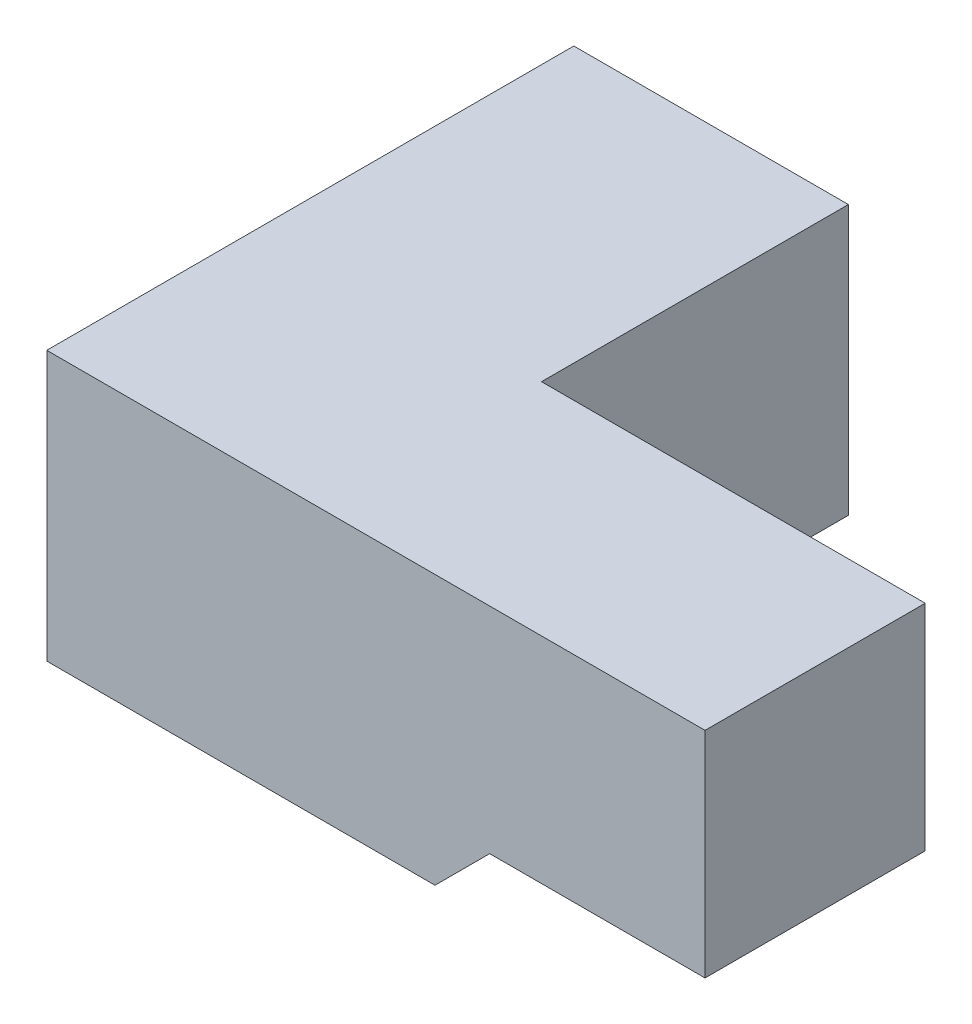
ISO-10303-21;
HEADER;
FILE_DESCRIPTION(('STEP AP214'),'2;1');
FILE_NAME('part.step','',(''),(''),'','','');
FILE_SCHEMA(('AUTOMOTIVE_DESIGN { 1 0 10303 214 1 1 1 1 }'));
ENDSEC;
DATA;
#1=APPLICATION_CONTEXT('core data for automotive mechanical design processes');
#2=APPLICATION_PROTOCOL_DEFINITION('international standard','automotive_design',2000,#1);
#3=PRODUCT_CONTEXT('',#1,'mechanical');
#4=PRODUCT('Part','Part','',(#3));
#5=PRODUCT_RELATED_PRODUCT_CATEGORY('part','',(#4));
#6=PRODUCT_DEFINITION_FORMATION('','',#4);
#7=PRODUCT_DEFINITION_CONTEXT('part definition',#1,'design');
#8=PRODUCT_DEFINITION('design','',#6,#7);
#9=PRODUCT_DEFINITION_SHAPE('','',#8);
#10=(LENGTH_UNIT() NAMED_UNIT(*) SI_UNIT(.MILLI.,.METRE.));
#11=(NAMED_UNIT(*) PLANE_ANGLE_UNIT() SI_UNIT($,.RADIAN.));
#12=(NAMED_UNIT(*) SI_UNIT($,.STERADIAN.) SOLID_ANGLE_UNIT());
#13=UNCERTAINTY_MEASURE_WITH_UNIT(LENGTH_MEASURE(1.E-05),#10,'distance_accuracy_value','');
#14=(GEOMETRIC_REPRESENTATION_CONTEXT(3) GLOBAL_UNCERTAINTY_ASSIGNED_CONTEXT((#13)) GLOBAL_UNIT_ASSIGNED_CONTEXT((#10,
#11,#12)) REPRESENTATION_CONTEXT('',''));
#15=CARTESIAN_POINT('',(0.,0.,0.));
#16=DIRECTION('',(0.,0.,1.));
#17=DIRECTION('',(1.,0.,0.));
#18=AXIS2_PLACEMENT_3D('',#15,#16,#17);
#19=CARTESIAN_POINT('',(967.750000000005,-148.400000000002,570.000000000018));
#20=DIRECTION('',(0.,-1.,0.));
#21=DIRECTION('',(0.,0.,-1.));
#22=AXIS2_PLACEMENT_3D('',#19,#20,#21);
#23=PLANE('',#22);
#24=DIRECTION('',(-1.,0.,0.));
#25=VECTOR('',#24,1.);
#26=CARTESIAN_POINT('',(967.750000000005,-148.400000000002,979.000000000015));
#27=LINE('',#26,#25);
#28=CARTESIAN_POINT('',(967.750000000005,-148.400000000002,979.000000000015));
#29=VERTEX_POINT('',#28);
#30=CARTESIAN_POINT('',(567.750000000008,-148.400000000002,979.000000000015));
#31=VERTEX_POINT('',#30);
#32=EDGE_CURVE('E130',#29,#31,#27,.T.);
#33=ORIENTED_EDGE('',*,*,#32,.T.);
#34=DIRECTION('',(0.,0.,1.));
#35=VECTOR('',#34,1.);
#36=CARTESIAN_POINT('',(567.750000000008,-148.400000000002,570.000000000018));
#37=LINE('',#36,#35);
#38=CARTESIAN_POINT('',(567.750000000008,-148.400000000002,570.000000000018));
#39=VERTEX_POINT('',#38);
#40=EDGE_CURVE('E11',#31,#39,#37,.F.);
#41=ORIENTED_EDGE('',*,*,#40,.T.);
#42=DIRECTION('',(-1.,0.,0.));
#43=VECTOR('',#42,1.);
#44=CARTESIAN_POINT('',(967.750000000005,-148.400000000002,570.000000000018));
#45=LINE('',#44,#43);
#46=CARTESIAN_POINT('',(967.750000000005,-148.400000000002,570.000000000018));
#47=VERTEX_POINT('',#46);
#48=EDGE_CURVE('E103',#47,#39,#45,.T.);
#49=ORIENTED_EDGE('',*,*,#48,.F.);
#50=DIRECTION('',(0.,0.,1.));
#51=VECTOR('',#50,1.);
#52=CARTESIAN_POINT('',(967.750000000005,-148.400000000002,570.000000000018));
#53=LINE('',#52,#51);
#54=EDGE_CURVE('E118',#47,#29,#53,.T.);
#55=ORIENTED_EDGE('',*,*,#54,.T.);
#56=EDGE_LOOP('',(#33,#41,#49,#55));
#57=FACE_BOUND('',#56,.T.);
#58=ADVANCED_FACE('F35',(#57),#23,.T.);
#59=CARTESIAN_POINT('',(-255.,250.,979.000000000015));
#60=DIRECTION('',(1.,0.,0.));
#61=DIRECTION('',(0.,0.,-1.));
#62=AXIS2_PLACEMENT_3D('',#59,#60,#61);
#63=PLANE('',#62);
#64=DIRECTION('',(0.,-1.,0.));
#65=VECTOR('',#64,1.);
#66=CARTESIAN_POINT('',(-255.,250.,0.));
#67=LINE('',#66,#65);
#68=CARTESIAN_POINT('',(-255.,250.,0.));
#69=VERTEX_POINT('',#68);
#70=CARTESIAN_POINT('',(-255.,-250.,0.));
#71=VERTEX_POINT('',#70);
#72=EDGE_CURVE('E135',#69,#71,#67,.T.);
#73=ORIENTED_EDGE('',*,*,#72,.T.);
#74=DIRECTION('',(0.,0.,-1.));
#75=VECTOR('',#74,1.);
#76=CARTESIAN_POINT('',(-255.,-250.,979.000000000015));
#77=LINE('',#76,#75);
#78=CARTESIAN_POINT('',(-255.,-250.,979.000000000015));
#79=VERTEX_POINT('',#78);
#80=EDGE_CURVE('E45',#79,#71,#77,.T.);
#81=ORIENTED_EDGE('',*,*,#80,.F.);
#82=DIRECTION('',(0.,-1.,0.));
#83=VECTOR('',#82,1.);
#84=CARTESIAN_POINT('',(-255.,250.,979.000000000015));
#85=LINE('',#84,#83);
#86=CARTESIAN_POINT('',(-255.,250.,979.000000000015));
#87=VERTEX_POINT('',#86);
#88=EDGE_CURVE('E136',#87,#79,#85,.T.);
#89=ORIENTED_EDGE('',*,*,#88,.F.);
#90=DIRECTION('',(0.,0.,-1.));
#91=VECTOR('',#90,1.);
#92=CARTESIAN_POINT('',(-255.,250.,979.000000000015));
#93=LINE('',#92,#91);
#94=EDGE_CURVE('E143',#87,#69,#93,.T.);
#95=ORIENTED_EDGE('',*,*,#94,.T.);
#96=EDGE_LOOP('',(#73,#81,#89,#95));
#97=FACE_BOUND('',#96,.T.);
#98=ADVANCED_FACE('F166',(#97),#63,.F.);
#99=CARTESIAN_POINT('',(-255.,-250.,979.000000000015));
#100=DIRECTION('',(0.,1.,0.));
#101=DIRECTION('',(0.,0.,1.));
#102=AXIS2_PLACEMENT_3D('',#99,#100,#101);
#103=PLANE('',#102);
#104=DIRECTION('',(0.,0.,-1.));
#105=VECTOR('',#104,1.);
#106=CARTESIAN_POINT('',(255.,-250.,979.000000000015));
#107=LINE('',#106,#105);
#108=CARTESIAN_POINT('',(255.,-250.,570.000000000016));
#109=VERTEX_POINT('',#108);
#110=CARTESIAN_POINT('',(255.,-250.,0.));
#111=VERTEX_POINT('',#110);
#112=EDGE_CURVE('E110',#109,#111,#107,.T.);
#113=ORIENTED_EDGE('',*,*,#112,.F.);
#114=DIRECTION('',(-1.,0.,0.));
#115=VECTOR('',#114,1.);
#116=CARTESIAN_POINT('',(466.15000000001,-250.,570.000000000016));
#117=LINE('',#116,#115);
#118=CARTESIAN_POINT('',(466.15000000001,-250.,570.000000000016));
#119=VERTEX_POINT('',#118);
#120=EDGE_CURVE('E100',#119,#109,#117,.T.);
#121=ORIENTED_EDGE('',*,*,#120,.F.);
#122=DIRECTION('',(0.,0.,1.));
#123=VECTOR('',#122,1.);
#124=CARTESIAN_POINT('',(466.15000000001,-250.,570.000000000016));
#125=LINE('',#124,#123);
#126=CARTESIAN_POINT('',(466.15000000001,-250.,979.000000000015));
#127=VERTEX_POINT('',#126);
#128=EDGE_CURVE('E104',#119,#127,#125,.T.);
#129=ORIENTED_EDGE('',*,*,#128,.T.);
#130=DIRECTION('',(1.,0.,0.));
#131=VECTOR('',#130,1.);
#132=CARTESIAN_POINT('',(-255.,-250.,979.000000000015));
#133=LINE('',#132,#131);
#134=EDGE_CURVE('E138',#79,#127,#133,.T.);
#135=ORIENTED_EDGE('',*,*,#134,.F.);
#136=ORIENTED_EDGE('',*,*,#80,.T.);
#137=DIRECTION('',(1.,0.,0.));
#138=VECTOR('',#137,1.);
#139=CARTESIAN_POINT('',(-255.,-250.,0.));
#140=LINE('',#139,#138);
#141=EDGE_CURVE('E146',#71,#111,#140,.T.);
#142=ORIENTED_EDGE('',*,*,#141,.T.);
#143=EDGE_LOOP('',(#113,#121,#129,#135,#136,#142));
#144=FACE_BOUND('',#143,.T.);
#145=ADVANCED_FACE('F107',(#144),#103,.F.);
#146=CARTESIAN_POINT('',(255.,250.,979.000000000015));
#147=DIRECTION('',(-1.,0.,0.));
#148=DIRECTION('',(0.,0.,1.));
#149=AXIS2_PLACEMENT_3D('',#146,#147,#148);
#150=PLANE('',#149);
#151=DIRECTION('',(0.,-1.,0.));
#152=VECTOR('',#151,1.);
#153=CARTESIAN_POINT('',(255.,250.,570.000000000018));
#154=LINE('',#153,#152);
#155=CARTESIAN_POINT('',(255.,250.,570.000000000018));
#156=VERTEX_POINT('',#155);
#157=EDGE_CURVE('E129',#156,#109,#154,.T.);
#158=ORIENTED_EDGE('',*,*,#157,.T.);
#159=ORIENTED_EDGE('',*,*,#112,.T.);
#160=DIRECTION('',(0.,1.,0.));
#161=VECTOR('',#160,1.);
#162=CARTESIAN_POINT('',(255.,250.,0.));
#163=LINE('',#162,#161);
#164=CARTESIAN_POINT('',(255.,250.,0.));
#165=VERTEX_POINT('',#164);
#166=EDGE_CURVE('E148',#111,#165,#163,.T.);
#167=ORIENTED_EDGE('',*,*,#166,.T.);
#168=DIRECTION('',(0.,0.,-1.));
#169=VECTOR('',#168,1.);
#170=CARTESIAN_POINT('',(255.,250.,979.000000000015));
#171=LINE('',#170,#169);
#172=EDGE_CURVE('E154',#156,#165,#171,.T.);
#173=ORIENTED_EDGE('',*,*,#172,.F.);
#174=EDGE_LOOP('',(#158,#159,#167,#173));
#175=FACE_BOUND('',#174,.T.);
#176=ADVANCED_FACE('F172',(#175),#150,.F.);
#177=CARTESIAN_POINT('',(-255.,250.,979.000000000015));
#178=DIRECTION('',(0.,-1.,0.));
#179=DIRECTION('',(0.,0.,-1.));
#180=AXIS2_PLACEMENT_3D('',#177,#178,#179);
#181=PLANE('',#180);
#182=DIRECTION('',(-1.,0.,0.));
#183=VECTOR('',#182,1.);
#184=CARTESIAN_POINT('',(-255.,250.,0.));
#185=LINE('',#184,#183);
#186=EDGE_CURVE('E139',#165,#69,#185,.T.);
#187=ORIENTED_EDGE('',*,*,#186,.T.);
#188=ORIENTED_EDGE('',*,*,#94,.F.);
#189=DIRECTION('',(-1.,0.,0.));
#190=VECTOR('',#189,1.);
#191=CARTESIAN_POINT('',(-255.,250.,979.000000000015));
#192=LINE('',#191,#190);
#193=CARTESIAN_POINT('',(967.750000000005,250.,979.000000000015));
#194=VERTEX_POINT('',#193);
#195=EDGE_CURVE('E141',#194,#87,#192,.T.);
#196=ORIENTED_EDGE('',*,*,#195,.F.);
#197=DIRECTION('',(0.,0.,-1.));
#198=VECTOR('',#197,1.);
#199=CARTESIAN_POINT('',(967.750000000005,250.,570.000000000018));
#200=LINE('',#199,#198);
#201=CARTESIAN_POINT('',(967.750000000005,250.,570.000000000018));
#202=VERTEX_POINT('',#201);
#203=EDGE_CURVE('E124',#194,#202,#200,.T.);
#204=ORIENTED_EDGE('',*,*,#203,.T.);
#205=DIRECTION('',(-1.,0.,0.));
#206=VECTOR('',#205,1.);
#207=CARTESIAN_POINT('',(967.750000000005,250.,570.000000000018));
#208=LINE('',#207,#206);
#209=EDGE_CURVE('E127',#202,#156,#208,.T.);
#210=ORIENTED_EDGE('',*,*,#209,.T.);
#211=ORIENTED_EDGE('',*,*,#172,.T.);
#212=EDGE_LOOP('',(#187,#188,#196,#204,#210,#211));
#213=FACE_BOUND('',#212,.T.);
#214=ADVANCED_FACE('F169',(#213),#181,.F.);
#215=CARTESIAN_POINT('',(0.,0.,979.000000000015));
#216=DIRECTION('',(0.,0.,1.));
#217=DIRECTION('',(1.,0.,0.));
#218=AXIS2_PLACEMENT_3D('',#215,#216,#217);
#219=PLANE('',#218);
#220=DIRECTION('',(-0.707106781186549,-0.707106781186546,0.));
#221=VECTOR('',#220,1.);
#222=CARTESIAN_POINT('',(466.15000000001,-250.,979.000000000015));
#223=LINE('',#222,#221);
#224=EDGE_CURVE('E39',#127,#31,#223,.F.);
#225=ORIENTED_EDGE('',*,*,#224,.T.);
#226=ORIENTED_EDGE('',*,*,#32,.F.);
#227=DIRECTION('',(0.,1.,0.));
#228=VECTOR('',#227,1.);
#229=CARTESIAN_POINT('',(967.750000000005,-148.400000000002,979.000000000015));
#230=LINE('',#229,#228);
#231=EDGE_CURVE('E121',#29,#194,#230,.T.);
#232=ORIENTED_EDGE('',*,*,#231,.T.);
#233=ORIENTED_EDGE('',*,*,#195,.T.);
#234=ORIENTED_EDGE('',*,*,#88,.T.);
#235=ORIENTED_EDGE('',*,*,#134,.T.);
#236=EDGE_LOOP('',(#225,#226,#232,#233,#234,#235));
#237=FACE_BOUND('',#236,.T.);
#238=ADVANCED_FACE('F180',(#237),#219,.T.);
#239=CARTESIAN_POINT('',(0.,0.,0.));
#240=DIRECTION('',(0.,0.,1.));
#241=DIRECTION('',(1.,0.,0.));
#242=AXIS2_PLACEMENT_3D('',#239,#240,#241);
#243=PLANE('',#242);
#244=ORIENTED_EDGE('',*,*,#72,.F.);
#245=ORIENTED_EDGE('',*,*,#186,.F.);
#246=ORIENTED_EDGE('',*,*,#166,.F.);
#247=ORIENTED_EDGE('',*,*,#141,.F.);
#248=EDGE_LOOP('',(#244,#245,#246,#247));
#249=FACE_BOUND('',#248,.T.);
#250=ADVANCED_FACE('F164',(#249),#243,.F.);
#251=CARTESIAN_POINT('',(967.750000000005,-148.400000000002,570.000000000018));
#252=DIRECTION('',(0.,0.,-1.));
#253=DIRECTION('',(-1.,0.,0.));
#254=AXIS2_PLACEMENT_3D('',#251,#252,#253);
#255=PLANE('',#254);
#256=ORIENTED_EDGE('',*,*,#157,.F.);
#257=ORIENTED_EDGE('',*,*,#209,.F.);
#258=DIRECTION('',(0.,-1.,0.));
#259=VECTOR('',#258,1.);
#260=CARTESIAN_POINT('',(967.750000000005,-148.400000000002,570.000000000018));
#261=LINE('',#260,#259);
#262=EDGE_CURVE('E111',#202,#47,#261,.T.);
#263=ORIENTED_EDGE('',*,*,#262,.T.);
#264=ORIENTED_EDGE('',*,*,#48,.T.);
#265=DIRECTION('',(0.707106781186549,0.707106781186546,0.));
#266=VECTOR('',#265,1.);
#267=CARTESIAN_POINT('',(466.15000000001,-250.,570.000000000018));
#268=LINE('',#267,#266);
#269=EDGE_CURVE('E53',#39,#119,#268,.F.);
#270=ORIENTED_EDGE('',*,*,#269,.T.);
#271=ORIENTED_EDGE('',*,*,#120,.T.);
#272=EDGE_LOOP('',(#256,#257,#263,#264,#270,#271));
#273=FACE_BOUND('',#272,.T.);
#274=ADVANCED_FACE('F99',(#273),#255,.T.);
#275=CARTESIAN_POINT('',(967.750000000005,0.,0.));
#276=DIRECTION('',(1.,0.,0.));
#277=DIRECTION('',(0.,0.,-1.));
#278=AXIS2_PLACEMENT_3D('',#275,#276,#277);
#279=PLANE('',#278);
#280=ORIENTED_EDGE('',*,*,#262,.F.);
#281=ORIENTED_EDGE('',*,*,#203,.F.);
#282=ORIENTED_EDGE('',*,*,#231,.F.);
#283=ORIENTED_EDGE('',*,*,#54,.F.);
#284=EDGE_LOOP('',(#280,#281,#282,#283));
#285=FACE_BOUND('',#284,.T.);
#286=ADVANCED_FACE('F177',(#285),#279,.T.);
#287=CARTESIAN_POINT('',(466.15000000001,-250.,570.000000000016));
#288=DIRECTION('',(0.707106781186546,-0.707106781186549,0.));
#289=DIRECTION('',(0.707106781186549,0.707106781186546,0.));
#290=AXIS2_PLACEMENT_3D('',#287,#288,#289);
#291=PLANE('',#290);
#292=ORIENTED_EDGE('',*,*,#40,.F.);
#293=ORIENTED_EDGE('',*,*,#224,.F.);
#294=ORIENTED_EDGE('',*,*,#128,.F.);
#295=ORIENTED_EDGE('',*,*,#269,.F.);
#296=EDGE_LOOP('',(#292,#293,#294,#295));
#297=FACE_BOUND('',#296,.T.);
#298=ADVANCED_FACE('F37',(#297),#291,.T.);
#299=CLOSED_SHELL('',(#58,#98,#145,#176,#214,#238,#250,#274,#286,#298));
#300=MANIFOLD_SOLID_BREP('B2',#299);
#301=ADVANCED_BREP_SHAPE_REPRESENTATION('',(#18,#300),#14);
#302=SHAPE_DEFINITION_REPRESENTATION(#9,#301);
ENDSEC;
END-ISO-10303-21;
